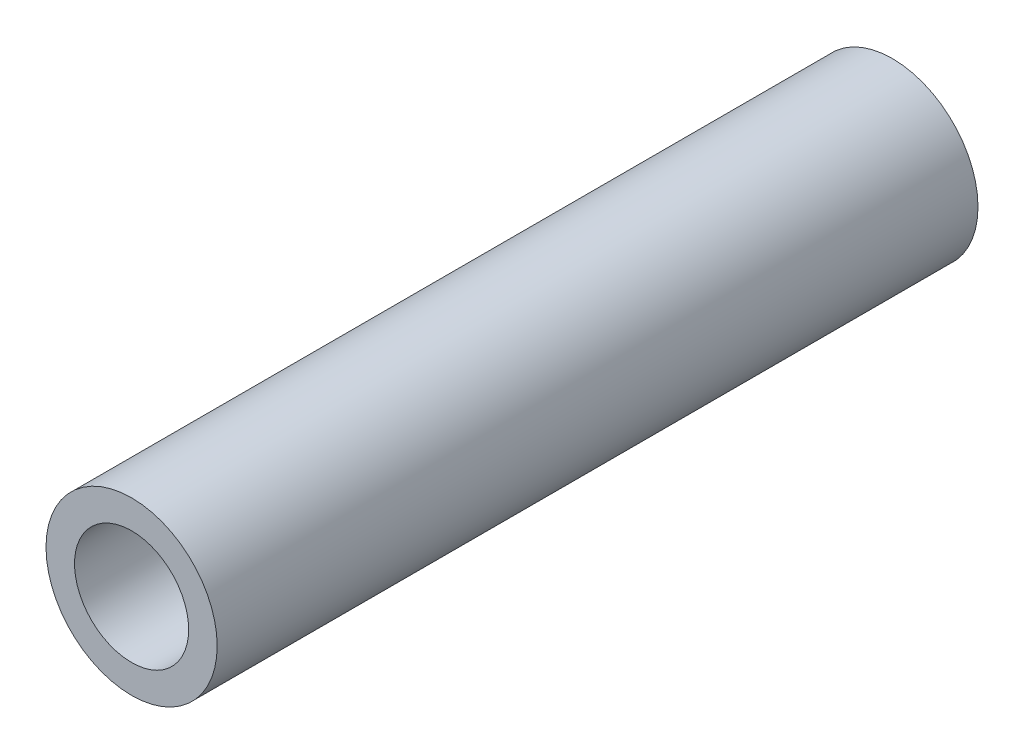
ISO-10303-21;
HEADER;
FILE_DESCRIPTION(('STEP AP214'),'2;1');
FILE_NAME('part.step','',(''),(''),'','','');
FILE_SCHEMA(('AUTOMOTIVE_DESIGN { 1 0 10303 214 1 1 1 1 }'));
ENDSEC;
DATA;
#1=APPLICATION_CONTEXT('core data for automotive mechanical design processes');
#2=APPLICATION_PROTOCOL_DEFINITION('international standard','automotive_design',2000,#1);
#3=PRODUCT_CONTEXT('',#1,'mechanical');
#4=PRODUCT('Part','Part','',(#3));
#5=PRODUCT_RELATED_PRODUCT_CATEGORY('part','',(#4));
#6=PRODUCT_DEFINITION_FORMATION('','',#4);
#7=PRODUCT_DEFINITION_CONTEXT('part definition',#1,'design');
#8=PRODUCT_DEFINITION('design','',#6,#7);
#9=PRODUCT_DEFINITION_SHAPE('','',#8);
#10=(LENGTH_UNIT() NAMED_UNIT(*) SI_UNIT(.MILLI.,.METRE.));
#11=(NAMED_UNIT(*) PLANE_ANGLE_UNIT() SI_UNIT($,.RADIAN.));
#12=(NAMED_UNIT(*) SI_UNIT($,.STERADIAN.) SOLID_ANGLE_UNIT());
#13=UNCERTAINTY_MEASURE_WITH_UNIT(LENGTH_MEASURE(1.E-05),#10,'distance_accuracy_value','');
#14=(GEOMETRIC_REPRESENTATION_CONTEXT(3) GLOBAL_UNCERTAINTY_ASSIGNED_CONTEXT((#13)) GLOBAL_UNIT_ASSIGNED_CONTEXT((#10,
#11,#12)) REPRESENTATION_CONTEXT('',''));
#15=CARTESIAN_POINT('',(0.,0.,0.));
#16=DIRECTION('',(0.,0.,1.));
#17=DIRECTION('',(1.,0.,0.));
#18=AXIS2_PLACEMENT_3D('',#15,#16,#17);
#19=CARTESIAN_POINT('',(0.,0.,80.));
#20=DIRECTION('',(0.,0.,1.));
#21=DIRECTION('',(1.,0.,0.));
#22=AXIS2_PLACEMENT_3D('',#19,#20,#21);
#23=PLANE('',#22);
#24=CARTESIAN_POINT('',(0.,0.,80.));
#25=DIRECTION('',(0.,0.,1.));
#26=DIRECTION('',(1.,0.,0.));
#27=AXIS2_PLACEMENT_3D('',#24,#25,#26);
#28=CIRCLE('',#27,9.);
#29=CARTESIAN_POINT('',(9.,0.,80.));
#30=VERTEX_POINT('',#29);
#31=EDGE_CURVE('E10',#30,#30,#28,.T.);
#32=ORIENTED_EDGE('',*,*,#31,.T.);
#33=EDGE_LOOP('',(#32));
#34=FACE_BOUND('',#33,.T.);
#35=CARTESIAN_POINT('',(0.,0.,80.));
#36=DIRECTION('',(0.,0.,1.));
#37=DIRECTION('',(1.,0.,0.));
#38=AXIS2_PLACEMENT_3D('',#35,#36,#37);
#39=CIRCLE('',#38,6.);
#40=CARTESIAN_POINT('',(6.,0.,80.));
#41=VERTEX_POINT('',#40);
#42=EDGE_CURVE('E42',#41,#41,#39,.T.);
#43=ORIENTED_EDGE('',*,*,#42,.F.);
#44=EDGE_LOOP('',(#43));
#45=FACE_BOUND('',#44,.T.);
#46=ADVANCED_FACE('F31',(#34,#45),#23,.T.);
#47=CARTESIAN_POINT('',(0.,0.,0.));
#48=DIRECTION('',(0.,0.,1.));
#49=DIRECTION('',(1.,0.,0.));
#50=AXIS2_PLACEMENT_3D('',#47,#48,#49);
#51=PLANE('',#50);
#52=CARTESIAN_POINT('',(0.,0.,0.));
#53=DIRECTION('',(0.,0.,1.));
#54=DIRECTION('',(1.,0.,0.));
#55=AXIS2_PLACEMENT_3D('',#52,#53,#54);
#56=CIRCLE('',#55,9.);
#57=CARTESIAN_POINT('',(9.,0.,0.));
#58=VERTEX_POINT('',#57);
#59=EDGE_CURVE('E35',#58,#58,#56,.T.);
#60=ORIENTED_EDGE('',*,*,#59,.F.);
#61=EDGE_LOOP('',(#60));
#62=FACE_BOUND('',#61,.T.);
#63=CARTESIAN_POINT('',(0.,0.,0.));
#64=DIRECTION('',(0.,0.,1.));
#65=DIRECTION('',(1.,0.,0.));
#66=AXIS2_PLACEMENT_3D('',#63,#64,#65);
#67=CIRCLE('',#66,6.);
#68=CARTESIAN_POINT('',(6.,0.,0.));
#69=VERTEX_POINT('',#68);
#70=EDGE_CURVE('E44',#69,#69,#67,.T.);
#71=ORIENTED_EDGE('',*,*,#70,.T.);
#72=EDGE_LOOP('',(#71));
#73=FACE_BOUND('',#72,.T.);
#74=ADVANCED_FACE('F54',(#62,#73),#51,.F.);
#75=CARTESIAN_POINT('',(0.,0.,80.));
#76=DIRECTION('',(0.,0.,-1.));
#77=DIRECTION('',(-1.,0.,0.));
#78=AXIS2_PLACEMENT_3D('',#75,#76,#77);
#79=CYLINDRICAL_SURFACE('',#78,9.);
#80=ORIENTED_EDGE('',*,*,#31,.F.);
#81=EDGE_LOOP('',(#80));
#82=FACE_BOUND('',#81,.T.);
#83=ORIENTED_EDGE('',*,*,#59,.T.);
#84=EDGE_LOOP('',(#83));
#85=FACE_BOUND('',#84,.T.);
#86=ADVANCED_FACE('F33',(#82,#85),#79,.T.);
#87=CARTESIAN_POINT('',(0.,0.,80.));
#88=DIRECTION('',(0.,0.,-1.));
#89=DIRECTION('',(-1.,0.,0.));
#90=AXIS2_PLACEMENT_3D('',#87,#88,#89);
#91=CYLINDRICAL_SURFACE('',#90,6.);
#92=ORIENTED_EDGE('',*,*,#42,.T.);
#93=EDGE_LOOP('',(#92));
#94=FACE_BOUND('',#93,.T.);
#95=ORIENTED_EDGE('',*,*,#70,.F.);
#96=EDGE_LOOP('',(#95));
#97=FACE_BOUND('',#96,.T.);
#98=ADVANCED_FACE('F50',(#94,#97),#91,.F.);
#99=CLOSED_SHELL('',(#46,#74,#86,#98));
#100=MANIFOLD_SOLID_BREP('B2',#99);
#101=ADVANCED_BREP_SHAPE_REPRESENTATION('',(#18,#100),#14);
#102=SHAPE_DEFINITION_REPRESENTATION(#9,#101);
ENDSEC;
END-ISO-10303-21;
